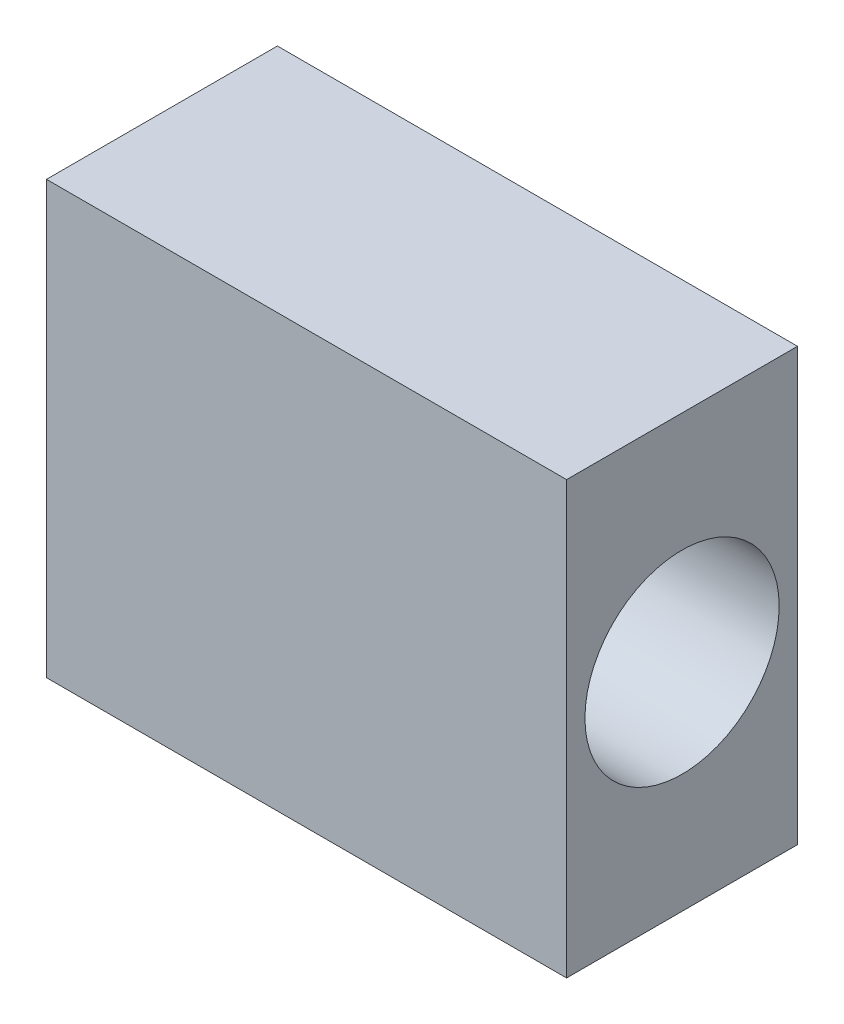
ISO-10303-21;
HEADER;
FILE_DESCRIPTION(('STEP AP214'),'2;1');
FILE_NAME('part.step','',(''),(''),'','','');
FILE_SCHEMA(('AUTOMOTIVE_DESIGN { 1 0 10303 214 1 1 1 1 }'));
ENDSEC;
DATA;
#1=APPLICATION_CONTEXT('core data for automotive mechanical design processes');
#2=APPLICATION_PROTOCOL_DEFINITION('international standard','automotive_design',2000,#1);
#3=PRODUCT_CONTEXT('',#1,'mechanical');
#4=PRODUCT('Part','Part','',(#3));
#5=PRODUCT_RELATED_PRODUCT_CATEGORY('part','',(#4));
#6=PRODUCT_DEFINITION_FORMATION('','',#4);
#7=PRODUCT_DEFINITION_CONTEXT('part definition',#1,'design');
#8=PRODUCT_DEFINITION('design','',#6,#7);
#9=PRODUCT_DEFINITION_SHAPE('','',#8);
#10=(LENGTH_UNIT() NAMED_UNIT(*) SI_UNIT(.MILLI.,.METRE.));
#11=(NAMED_UNIT(*) PLANE_ANGLE_UNIT() SI_UNIT($,.RADIAN.));
#12=(NAMED_UNIT(*) SI_UNIT($,.STERADIAN.) SOLID_ANGLE_UNIT());
#13=UNCERTAINTY_MEASURE_WITH_UNIT(LENGTH_MEASURE(1.E-05),#10,'distance_accuracy_value','');
#14=(GEOMETRIC_REPRESENTATION_CONTEXT(3) GLOBAL_UNCERTAINTY_ASSIGNED_CONTEXT((#13)) GLOBAL_UNIT_ASSIGNED_CONTEXT((#10,
#11,#12)) REPRESENTATION_CONTEXT('',''));
#15=CARTESIAN_POINT('',(0.,0.,0.));
#16=DIRECTION('',(0.,0.,1.));
#17=DIRECTION('',(1.,0.,0.));
#18=AXIS2_PLACEMENT_3D('',#15,#16,#17);
#19=CARTESIAN_POINT('',(0.,10.,0.));
#20=DIRECTION('',(1.,0.,0.));
#21=DIRECTION('',(0.,0.,-1.));
#22=AXIS2_PLACEMENT_3D('',#19,#20,#21);
#23=PLANE('',#22);
#24=CARTESIAN_POINT('',(0.,5.,-2.675));
#25=DIRECTION('',(-1.,0.,0.));
#26=DIRECTION('',(0.,0.,1.));
#27=AXIS2_PLACEMENT_3D('',#24,#25,#26);
#28=CIRCLE('',#27,2.25);
#29=CARTESIAN_POINT('',(0.,5.,-0.425));
#30=VERTEX_POINT('',#29);
#31=EDGE_CURVE('E118',#30,#30,#28,.T.);
#32=ORIENTED_EDGE('',*,*,#31,.F.);
#33=EDGE_LOOP('',(#32));
#34=FACE_BOUND('',#33,.T.);
#35=DIRECTION('',(0.,0.,1.));
#36=VECTOR('',#35,1.);
#37=CARTESIAN_POINT('',(0.,0.,0.));
#38=LINE('',#37,#36);
#39=CARTESIAN_POINT('',(0.,0.,-5.35));
#40=VERTEX_POINT('',#39);
#41=CARTESIAN_POINT('',(0.,0.,0.));
#42=VERTEX_POINT('',#41);
#43=EDGE_CURVE('E102',#40,#42,#38,.T.);
#44=ORIENTED_EDGE('',*,*,#43,.T.);
#45=DIRECTION('',(0.,-1.,0.));
#46=VECTOR('',#45,1.);
#47=CARTESIAN_POINT('',(0.,10.,0.));
#48=LINE('',#47,#46);
#49=CARTESIAN_POINT('',(0.,10.,0.));
#50=VERTEX_POINT('',#49);
#51=EDGE_CURVE('E11',#50,#42,#48,.T.);
#52=ORIENTED_EDGE('',*,*,#51,.F.);
#53=DIRECTION('',(0.,0.,1.));
#54=VECTOR('',#53,1.);
#55=CARTESIAN_POINT('',(0.,10.,0.));
#56=LINE('',#55,#54);
#57=CARTESIAN_POINT('',(0.,10.,-5.35));
#58=VERTEX_POINT('',#57);
#59=EDGE_CURVE('E90',#58,#50,#56,.T.);
#60=ORIENTED_EDGE('',*,*,#59,.F.);
#61=DIRECTION('',(0.,-1.,0.));
#62=VECTOR('',#61,1.);
#63=CARTESIAN_POINT('',(0.,10.,-5.35));
#64=LINE('',#63,#62);
#65=EDGE_CURVE('E98',#58,#40,#64,.T.);
#66=ORIENTED_EDGE('',*,*,#65,.T.);
#67=EDGE_LOOP('',(#44,#52,#60,#66));
#68=FACE_BOUND('',#67,.T.);
#69=ADVANCED_FACE('F39',(#34,#68),#23,.F.);
#70=CARTESIAN_POINT('',(0.,10.,0.));
#71=DIRECTION('',(0.,0.,-1.));
#72=DIRECTION('',(-1.,0.,0.));
#73=AXIS2_PLACEMENT_3D('',#70,#71,#72);
#74=PLANE('',#73);
#75=DIRECTION('',(1.,0.,0.));
#76=VECTOR('',#75,1.);
#77=CARTESIAN_POINT('',(0.,0.,0.));
#78=LINE('',#77,#76);
#79=CARTESIAN_POINT('',(12.05,0.,0.));
#80=VERTEX_POINT('',#79);
#81=EDGE_CURVE('E94',#42,#80,#78,.T.);
#82=ORIENTED_EDGE('',*,*,#81,.T.);
#83=DIRECTION('',(0.,-1.,0.));
#84=VECTOR('',#83,1.);
#85=CARTESIAN_POINT('',(12.05,10.,0.));
#86=LINE('',#85,#84);
#87=CARTESIAN_POINT('',(12.05,10.,0.));
#88=VERTEX_POINT('',#87);
#89=EDGE_CURVE('E47',#88,#80,#86,.T.);
#90=ORIENTED_EDGE('',*,*,#89,.F.);
#91=DIRECTION('',(1.,0.,0.));
#92=VECTOR('',#91,1.);
#93=CARTESIAN_POINT('',(0.,10.,0.));
#94=LINE('',#93,#92);
#95=EDGE_CURVE('E85',#50,#88,#94,.T.);
#96=ORIENTED_EDGE('',*,*,#95,.F.);
#97=ORIENTED_EDGE('',*,*,#51,.T.);
#98=EDGE_LOOP('',(#82,#90,#96,#97));
#99=FACE_BOUND('',#98,.T.);
#100=ADVANCED_FACE('F93',(#99),#74,.F.);
#101=CARTESIAN_POINT('',(12.05,10.,0.));
#102=DIRECTION('',(-1.,0.,0.));
#103=DIRECTION('',(0.,0.,1.));
#104=AXIS2_PLACEMENT_3D('',#101,#102,#103);
#105=PLANE('',#104);
#106=CARTESIAN_POINT('',(12.05,5.,-2.675));
#107=DIRECTION('',(-1.,0.,0.));
#108=DIRECTION('',(0.,0.,1.));
#109=AXIS2_PLACEMENT_3D('',#106,#107,#108);
#110=CIRCLE('',#109,2.25);
#111=CARTESIAN_POINT('',(12.05,5.,-0.425));
#112=VERTEX_POINT('',#111);
#113=EDGE_CURVE('E105',#112,#112,#110,.F.);
#114=ORIENTED_EDGE('',*,*,#113,.F.);
#115=EDGE_LOOP('',(#114));
#116=FACE_BOUND('',#115,.T.);
#117=DIRECTION('',(0.,0.,-1.));
#118=VECTOR('',#117,1.);
#119=CARTESIAN_POINT('',(12.05,0.,0.));
#120=LINE('',#119,#118);
#121=CARTESIAN_POINT('',(12.05,0.,-5.35));
#122=VERTEX_POINT('',#121);
#123=EDGE_CURVE('E72',#80,#122,#120,.T.);
#124=ORIENTED_EDGE('',*,*,#123,.T.);
#125=DIRECTION('',(0.,-1.,0.));
#126=VECTOR('',#125,1.);
#127=CARTESIAN_POINT('',(12.05,10.,-5.35));
#128=LINE('',#127,#126);
#129=CARTESIAN_POINT('',(12.05,10.,-5.35));
#130=VERTEX_POINT('',#129);
#131=EDGE_CURVE('E95',#130,#122,#128,.T.);
#132=ORIENTED_EDGE('',*,*,#131,.F.);
#133=DIRECTION('',(0.,0.,-1.));
#134=VECTOR('',#133,1.);
#135=CARTESIAN_POINT('',(12.05,10.,0.));
#136=LINE('',#135,#134);
#137=EDGE_CURVE('E88',#88,#130,#136,.T.);
#138=ORIENTED_EDGE('',*,*,#137,.F.);
#139=ORIENTED_EDGE('',*,*,#89,.T.);
#140=EDGE_LOOP('',(#124,#132,#138,#139));
#141=FACE_BOUND('',#140,.T.);
#142=ADVANCED_FACE('F96',(#116,#141),#105,.F.);
#143=CARTESIAN_POINT('',(0.,10.,-5.35));
#144=DIRECTION('',(0.,0.,1.));
#145=DIRECTION('',(1.,0.,0.));
#146=AXIS2_PLACEMENT_3D('',#143,#144,#145);
#147=PLANE('',#146);
#148=DIRECTION('',(-1.,0.,0.));
#149=VECTOR('',#148,1.);
#150=CARTESIAN_POINT('',(0.,0.,-5.35));
#151=LINE('',#150,#149);
#152=EDGE_CURVE('E78',#122,#40,#151,.T.);
#153=ORIENTED_EDGE('',*,*,#152,.T.);
#154=ORIENTED_EDGE('',*,*,#65,.F.);
#155=DIRECTION('',(-1.,0.,0.));
#156=VECTOR('',#155,1.);
#157=CARTESIAN_POINT('',(0.,10.,-5.35));
#158=LINE('',#157,#156);
#159=EDGE_CURVE('E55',#130,#58,#158,.T.);
#160=ORIENTED_EDGE('',*,*,#159,.F.);
#161=ORIENTED_EDGE('',*,*,#131,.T.);
#162=EDGE_LOOP('',(#153,#154,#160,#161));
#163=FACE_BOUND('',#162,.T.);
#164=ADVANCED_FACE('F110',(#163),#147,.F.);
#165=CARTESIAN_POINT('',(0.,10.,0.));
#166=DIRECTION('',(0.,-1.,0.));
#167=DIRECTION('',(0.,0.,-1.));
#168=AXIS2_PLACEMENT_3D('',#165,#166,#167);
#169=PLANE('',#168);
#170=ORIENTED_EDGE('',*,*,#59,.T.);
#171=ORIENTED_EDGE('',*,*,#95,.T.);
#172=ORIENTED_EDGE('',*,*,#137,.T.);
#173=ORIENTED_EDGE('',*,*,#159,.T.);
#174=EDGE_LOOP('',(#170,#171,#172,#173));
#175=FACE_BOUND('',#174,.T.);
#176=ADVANCED_FACE('F86',(#175),#169,.F.);
#177=CARTESIAN_POINT('',(0.,0.,0.));
#178=DIRECTION('',(0.,-1.,0.));
#179=DIRECTION('',(0.,0.,-1.));
#180=AXIS2_PLACEMENT_3D('',#177,#178,#179);
#181=PLANE('',#180);
#182=ORIENTED_EDGE('',*,*,#43,.F.);
#183=ORIENTED_EDGE('',*,*,#152,.F.);
#184=ORIENTED_EDGE('',*,*,#123,.F.);
#185=ORIENTED_EDGE('',*,*,#81,.F.);
#186=EDGE_LOOP('',(#182,#183,#184,#185));
#187=FACE_BOUND('',#186,.T.);
#188=ADVANCED_FACE('F113',(#187),#181,.T.);
#189=CARTESIAN_POINT('',(18.4139610306789,5.,-2.675));
#190=DIRECTION('',(-1.,0.,0.));
#191=DIRECTION('',(0.,0.,1.));
#192=AXIS2_PLACEMENT_3D('',#189,#190,#191);
#193=CYLINDRICAL_SURFACE('',#192,2.25);
#194=ORIENTED_EDGE('',*,*,#113,.T.);
#195=EDGE_LOOP('',(#194));
#196=FACE_BOUND('',#195,.T.);
#197=ORIENTED_EDGE('',*,*,#31,.T.);
#198=EDGE_LOOP('',(#197));
#199=FACE_BOUND('',#198,.T.);
#200=ADVANCED_FACE('F122',(#196,#199),#193,.F.);
#201=CLOSED_SHELL('',(#69,#100,#142,#164,#176,#188,#200));
#202=MANIFOLD_SOLID_BREP('B2',#201);
#203=ADVANCED_BREP_SHAPE_REPRESENTATION('',(#18,#202),#14);
#204=SHAPE_DEFINITION_REPRESENTATION(#9,#203);
ENDSEC;
END-ISO-10303-21;
